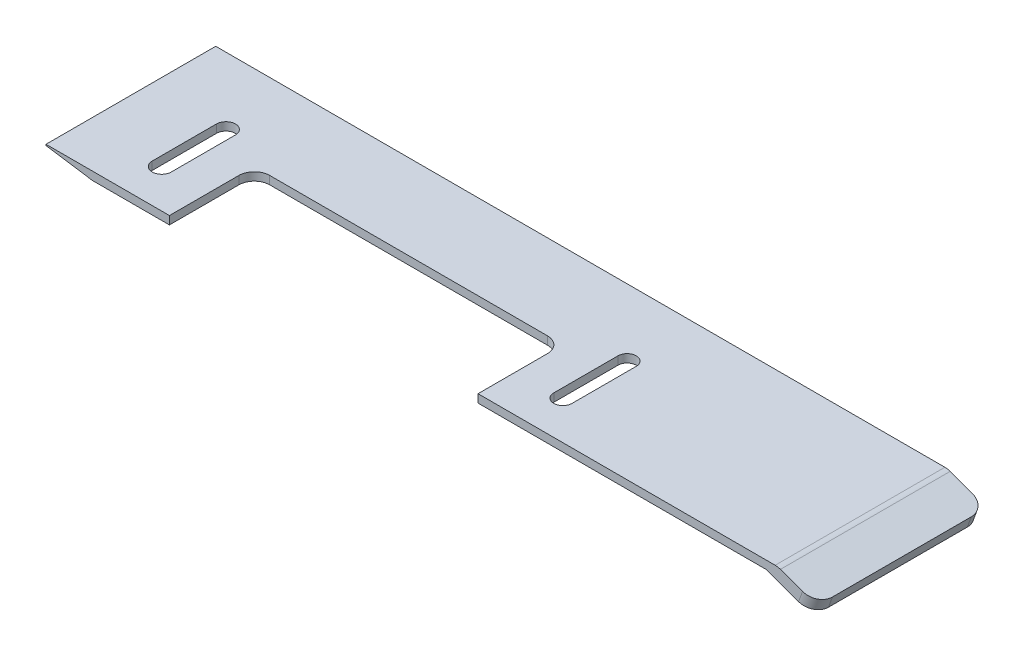
ISO-10303-21;
HEADER;
FILE_DESCRIPTION(('STEP AP214'),'2;1');
FILE_NAME('part.step','',(''),(''),'','','');
FILE_SCHEMA(('AUTOMOTIVE_DESIGN { 1 0 10303 214 1 1 1 1 }'));
ENDSEC;
DATA;
#1=APPLICATION_CONTEXT('core data for automotive mechanical design processes');
#2=APPLICATION_PROTOCOL_DEFINITION('international standard','automotive_design',2000,#1);
#3=PRODUCT_CONTEXT('',#1,'mechanical');
#4=PRODUCT('Part','Part','',(#3));
#5=PRODUCT_RELATED_PRODUCT_CATEGORY('part','',(#4));
#6=PRODUCT_DEFINITION_FORMATION('','',#4);
#7=PRODUCT_DEFINITION_CONTEXT('part definition',#1,'design');
#8=PRODUCT_DEFINITION('design','',#6,#7);
#9=PRODUCT_DEFINITION_SHAPE('','',#8);
#10=(LENGTH_UNIT() NAMED_UNIT(*) SI_UNIT(.MILLI.,.METRE.));
#11=(NAMED_UNIT(*) PLANE_ANGLE_UNIT() SI_UNIT($,.RADIAN.));
#12=(NAMED_UNIT(*) SI_UNIT($,.STERADIAN.) SOLID_ANGLE_UNIT());
#13=UNCERTAINTY_MEASURE_WITH_UNIT(LENGTH_MEASURE(1.E-05),#10,'distance_accuracy_value','');
#14=(GEOMETRIC_REPRESENTATION_CONTEXT(3) GLOBAL_UNCERTAINTY_ASSIGNED_CONTEXT((#13)) GLOBAL_UNIT_ASSIGNED_CONTEXT((#10,
#11,#12)) REPRESENTATION_CONTEXT('',''));
#15=CARTESIAN_POINT('',(0.,0.,0.));
#16=DIRECTION('',(0.,0.,1.));
#17=DIRECTION('',(1.,0.,0.));
#18=AXIS2_PLACEMENT_3D('',#15,#16,#17);
#19=CARTESIAN_POINT('',(0.,0.,22.));
#20=DIRECTION('',(0.,0.,-1.));
#21=DIRECTION('',(-1.,0.,0.));
#22=AXIS2_PLACEMENT_3D('',#19,#20,#21);
#23=PLANE('',#22);
#24=DIRECTION('',(-1.,0.,0.));
#25=VECTOR('',#24,1.);
#26=CARTESIAN_POINT('',(-70.9220106473936,6.21881141029235,22.));
#27=LINE('',#26,#25);
#28=CARTESIAN_POINT('',(23.5939315975531,6.21881141029235,22.));
#29=VERTEX_POINT('',#28);
#30=CARTESIAN_POINT('',(-14.9220106473936,6.21881141029235,22.));
#31=VERTEX_POINT('',#30);
#32=EDGE_CURVE('E277',#29,#31,#27,.T.);
#33=ORIENTED_EDGE('',*,*,#32,.T.);
#34=DIRECTION('',(0.,-1.,0.));
#35=VECTOR('',#34,1.);
#36=CARTESIAN_POINT('',(-14.9220106473936,0.,22.));
#37=LINE('',#36,#35);
#38=CARTESIAN_POINT('',(-14.9220106473936,5.16084952604156,22.));
#39=VERTEX_POINT('',#38);
#40=EDGE_CURVE('E341',#31,#39,#37,.T.);
#41=ORIENTED_EDGE('',*,*,#40,.T.);
#42=DIRECTION('',(1.,0.,0.));
#43=VECTOR('',#42,1.);
#44=CARTESIAN_POINT('',(22.4676053463481,5.16084952604156,22.));
#45=LINE('',#44,#43);
#46=CARTESIAN_POINT('',(22.4676053463481,5.16084952604156,22.));
#47=VERTEX_POINT('',#46);
#48=EDGE_CURVE('E266',#39,#47,#45,.T.);
#49=ORIENTED_EDGE('',*,*,#48,.T.);
#50=DIRECTION('',(0.939692620785908,-0.34202014332567,0.));
#51=VECTOR('',#50,1.);
#52=CARTESIAN_POINT('',(28.5078954962255,2.96236370515487,22.));
#53=LINE('',#52,#51);
#54=CARTESIAN_POINT('',(26.6285102546537,3.64640399180621,22.));
#55=VERTEX_POINT('',#54);
#56=EDGE_CURVE('E270',#47,#55,#53,.T.);
#57=ORIENTED_EDGE('',*,*,#56,.T.);
#58=DIRECTION('',(0.342020143325671,0.939692620785908,0.));
#59=VECTOR('',#58,1.);
#60=CARTESIAN_POINT('',(22.3416346289616,-8.1316899897931,22.));
#61=LINE('',#60,#59);
#62=CARTESIAN_POINT('',(27.1415404696422,5.05594292298507,22.));
#63=VERTEX_POINT('',#62);
#64=EDGE_CURVE('E311',#55,#63,#61,.T.);
#65=ORIENTED_EDGE('',*,*,#64,.T.);
#66=DIRECTION('',(-0.939692620785908,0.342020143325669,0.));
#67=VECTOR('',#66,1.);
#68=CARTESIAN_POINT('',(23.9465855589701,6.21881141029235,22.));
#69=LINE('',#68,#67);
#70=CARTESIAN_POINT('',(24.2779718842044,6.09819665186417,22.));
#71=VERTEX_POINT('',#70);
#72=EDGE_CURVE('E273',#63,#71,#69,.T.);
#73=ORIENTED_EDGE('',*,*,#72,.T.);
#74=CARTESIAN_POINT('',(23.5939315975531,4.21881141029235,22.));
#75=DIRECTION('',(0.,0.,-1.));
#76=DIRECTION('',(-1.,0.,0.));
#77=AXIS2_PLACEMENT_3D('',#74,#75,#76);
#78=CIRCLE('',#77,2.);
#79=EDGE_CURVE('E336',#71,#29,#78,.F.);
#80=ORIENTED_EDGE('',*,*,#79,.T.);
#81=EDGE_LOOP('',(#33,#41,#49,#57,#65,#73,#80));
#82=FACE_BOUND('',#81,.T.);
#83=ADVANCED_FACE('F33',(#82),#23,.F.);
#84=CARTESIAN_POINT('',(-70.9220106473936,6.06099027058349,22.));
#85=DIRECTION('',(1.,0.,0.));
#86=DIRECTION('',(0.,0.,-1.));
#87=AXIS2_PLACEMENT_3D('',#84,#85,#86);
#88=PLANE('',#87);
#89=DIRECTION('',(0.,-1.,0.));
#90=VECTOR('',#89,1.);
#91=CARTESIAN_POINT('',(-70.9220106473936,6.06099027058349,0.));
#92=LINE('',#91,#90);
#93=CARTESIAN_POINT('',(-70.9220106473936,6.21881141029235,0.));
#94=VERTEX_POINT('',#93);
#95=CARTESIAN_POINT('',(-70.9220106473936,6.06099027058349,0.));
#96=VERTEX_POINT('',#95);
#97=EDGE_CURVE('E259',#94,#96,#92,.T.);
#98=ORIENTED_EDGE('',*,*,#97,.T.);
#99=DIRECTION('',(0.,0.,-1.));
#100=VECTOR('',#99,1.);
#101=CARTESIAN_POINT('',(-70.9220106473936,6.06099027058349,22.));
#102=LINE('',#101,#100);
#103=CARTESIAN_POINT('',(-70.9220106473936,6.06099027058349,22.));
#104=VERTEX_POINT('',#103);
#105=EDGE_CURVE('E308',#104,#96,#102,.T.);
#106=ORIENTED_EDGE('',*,*,#105,.F.);
#107=DIRECTION('',(0.,-1.,0.));
#108=VECTOR('',#107,1.);
#109=CARTESIAN_POINT('',(-70.9220106473936,6.06099027058349,22.));
#110=LINE('',#109,#108);
#111=CARTESIAN_POINT('',(-70.9220106473936,6.21881141029235,22.));
#112=VERTEX_POINT('',#111);
#113=EDGE_CURVE('E260',#112,#104,#110,.T.);
#114=ORIENTED_EDGE('',*,*,#113,.F.);
#115=DIRECTION('',(0.,0.,-1.));
#116=VECTOR('',#115,1.);
#117=CARTESIAN_POINT('',(-70.9220106473936,6.21881141029235,22.));
#118=LINE('',#117,#116);
#119=EDGE_CURVE('E280',#112,#94,#118,.T.);
#120=ORIENTED_EDGE('',*,*,#119,.T.);
#121=EDGE_LOOP('',(#98,#106,#114,#120));
#122=FACE_BOUND('',#121,.T.);
#123=ADVANCED_FACE('F444',(#122),#88,.F.);
#124=CARTESIAN_POINT('',(-64.9220106473936,5.16084952604155,22.));
#125=DIRECTION('',(0.148363140244914,0.988932949505005,0.));
#126=DIRECTION('',(-0.988932949505005,0.148363140244914,0.));
#127=AXIS2_PLACEMENT_3D('',#124,#125,#126);
#128=PLANE('',#127);
#129=DIRECTION('',(0.988932949505005,-0.148363140244914,0.));
#130=VECTOR('',#129,1.);
#131=CARTESIAN_POINT('',(-64.9220106473936,5.16084952604155,0.));
#132=LINE('',#131,#130);
#133=CARTESIAN_POINT('',(-64.9220106473936,5.16084952604155,0.));
#134=VERTEX_POINT('',#133);
#135=EDGE_CURVE('E283',#96,#134,#132,.T.);
#136=ORIENTED_EDGE('',*,*,#135,.T.);
#137=DIRECTION('',(0.,0.,-1.));
#138=VECTOR('',#137,1.);
#139=CARTESIAN_POINT('',(-64.9220106473936,5.16084952604155,22.));
#140=LINE('',#139,#138);
#141=CARTESIAN_POINT('',(-64.9220106473936,5.16084952604155,22.));
#142=VERTEX_POINT('',#141);
#143=EDGE_CURVE('E305',#142,#134,#140,.T.);
#144=ORIENTED_EDGE('',*,*,#143,.F.);
#145=DIRECTION('',(0.988932949505005,-0.148363140244914,0.));
#146=VECTOR('',#145,1.);
#147=CARTESIAN_POINT('',(-64.9220106473936,5.16084952604155,22.));
#148=LINE('',#147,#146);
#149=EDGE_CURVE('E263',#104,#142,#148,.T.);
#150=ORIENTED_EDGE('',*,*,#149,.F.);
#151=ORIENTED_EDGE('',*,*,#105,.T.);
#152=EDGE_LOOP('',(#136,#144,#150,#151));
#153=FACE_BOUND('',#152,.T.);
#154=ADVANCED_FACE('F446',(#153),#128,.F.);
#155=CARTESIAN_POINT('',(22.4676053463481,5.16084952604156,22.));
#156=DIRECTION('',(0.,1.,0.));
#157=DIRECTION('',(-1.,0.,0.));
#158=AXIS2_PLACEMENT_3D('',#155,#156,#157);
#159=PLANE('',#158);
#160=DIRECTION('',(0.,0.,1.));
#161=VECTOR('',#160,1.);
#162=CARTESIAN_POINT('',(-59.6885627096651,5.16084952604156,8.67422642033291));
#163=LINE('',#162,#161);
#164=CARTESIAN_POINT('',(-59.6885627096651,5.16084952604156,8.67422642033291));
#165=VERTEX_POINT('',#164);
#166=CARTESIAN_POINT('',(-59.6885627096651,5.16084952604156,17.));
#167=VERTEX_POINT('',#166);
#168=EDGE_CURVE('E209',#165,#167,#163,.T.);
#169=ORIENTED_EDGE('',*,*,#168,.F.);
#170=CARTESIAN_POINT('',(-60.9220106473936,5.16084952604156,8.67422642033291));
#171=DIRECTION('',(0.,-1.,0.));
#172=DIRECTION('',(1.,0.,0.));
#173=AXIS2_PLACEMENT_3D('',#170,#171,#172);
#174=CIRCLE('',#173,1.23344793772846);
#175=CARTESIAN_POINT('',(-62.155458585122,5.16084952604155,8.67422642033291));
#176=VERTEX_POINT('',#175);
#177=EDGE_CURVE('E214',#176,#165,#174,.T.);
#178=ORIENTED_EDGE('',*,*,#177,.F.);
#179=DIRECTION('',(0.,0.,-1.));
#180=VECTOR('',#179,1.);
#181=CARTESIAN_POINT('',(-62.155458585122,5.16084952604155,8.67422642033291));
#182=LINE('',#181,#180);
#183=CARTESIAN_POINT('',(-62.155458585122,5.16084952604156,17.));
#184=VERTEX_POINT('',#183);
#185=EDGE_CURVE('E219',#184,#176,#182,.T.);
#186=ORIENTED_EDGE('',*,*,#185,.F.);
#187=CARTESIAN_POINT('',(-60.9220106473936,5.16084952604156,17.));
#188=DIRECTION('',(0.,-1.,0.));
#189=DIRECTION('',(1.,0.,0.));
#190=AXIS2_PLACEMENT_3D('',#187,#188,#189);
#191=CIRCLE('',#190,1.23344793772846);
#192=EDGE_CURVE('E198',#167,#184,#191,.T.);
#193=ORIENTED_EDGE('',*,*,#192,.F.);
#194=EDGE_LOOP('',(#169,#178,#186,#193));
#195=FACE_BOUND('',#194,.T.);
#196=DIRECTION('',(0.,0.,1.));
#197=VECTOR('',#196,1.);
#198=CARTESIAN_POINT('',(-7.73995637373713,5.16084952604156,8.67422642033291));
#199=LINE('',#198,#197);
#200=CARTESIAN_POINT('',(-7.73995637373713,5.16084952604156,8.67422642033291));
#201=VERTEX_POINT('',#200);
#202=CARTESIAN_POINT('',(-7.73995637373713,5.16084952604156,17.));
#203=VERTEX_POINT('',#202);
#204=EDGE_CURVE('E231',#201,#203,#199,.T.);
#205=ORIENTED_EDGE('',*,*,#204,.F.);
#206=CARTESIAN_POINT('',(-8.92201064739357,5.16084952604156,8.67422642033291));
#207=DIRECTION('',(0.,-1.,0.));
#208=DIRECTION('',(1.,0.,0.));
#209=AXIS2_PLACEMENT_3D('',#206,#207,#208);
#210=CIRCLE('',#209,1.18205427365644);
#211=CARTESIAN_POINT('',(-10.10406492105,5.16084952604156,8.67422642033291));
#212=VERTEX_POINT('',#211);
#213=EDGE_CURVE('E229',#212,#201,#210,.T.);
#214=ORIENTED_EDGE('',*,*,#213,.F.);
#215=DIRECTION('',(0.,0.,-1.));
#216=VECTOR('',#215,1.);
#217=CARTESIAN_POINT('',(-10.10406492105,5.16084952604156,8.67422642033291));
#218=LINE('',#217,#216);
#219=CARTESIAN_POINT('',(-10.10406492105,5.16084952604156,17.));
#220=VERTEX_POINT('',#219);
#221=EDGE_CURVE('E237',#220,#212,#218,.T.);
#222=ORIENTED_EDGE('',*,*,#221,.F.);
#223=CARTESIAN_POINT('',(-8.92201064739357,5.16084952604156,17.));
#224=DIRECTION('',(0.,-1.,0.));
#225=DIRECTION('',(1.,0.,0.));
#226=AXIS2_PLACEMENT_3D('',#223,#224,#225);
#227=CIRCLE('',#226,1.18205427365644);
#228=EDGE_CURVE('E234',#203,#220,#227,.T.);
#229=ORIENTED_EDGE('',*,*,#228,.F.);
#230=EDGE_LOOP('',(#205,#214,#222,#229));
#231=FACE_BOUND('',#230,.T.);
#232=ORIENTED_EDGE('',*,*,#48,.F.);
#233=DIRECTION('',(0.,0.,1.));
#234=VECTOR('',#233,1.);
#235=CARTESIAN_POINT('',(-14.9220106473936,5.16084952604156,29.4559216488466));
#236=LINE('',#235,#234);
#237=CARTESIAN_POINT('',(-14.9220106473936,5.16084952604156,13.));
#238=VERTEX_POINT('',#237);
#239=EDGE_CURVE('E226',#238,#39,#236,.T.);
#240=ORIENTED_EDGE('',*,*,#239,.F.);
#241=CARTESIAN_POINT('',(-16.9220106473936,5.16084952604156,13.));
#242=DIRECTION('',(0.,1.,0.));
#243=DIRECTION('',(-1.,0.,0.));
#244=AXIS2_PLACEMENT_3D('',#241,#242,#243);
#245=CIRCLE('',#244,2.);
#246=CARTESIAN_POINT('',(-16.9220106473936,5.16084952604156,11.));
#247=VERTEX_POINT('',#246);
#248=EDGE_CURVE('E377',#238,#247,#245,.T.);
#249=ORIENTED_EDGE('',*,*,#248,.T.);
#250=DIRECTION('',(1.,0.,0.));
#251=VECTOR('',#250,1.);
#252=CARTESIAN_POINT('',(-14.9220106473936,5.16084952604156,11.));
#253=LINE('',#252,#251);
#254=CARTESIAN_POINT('',(-52.9220106473936,5.16084952604156,11.));
#255=VERTEX_POINT('',#254);
#256=EDGE_CURVE('E252',#255,#247,#253,.T.);
#257=ORIENTED_EDGE('',*,*,#256,.F.);
#258=CARTESIAN_POINT('',(-52.9220106473936,5.16084952604156,13.));
#259=DIRECTION('',(0.,1.,0.));
#260=DIRECTION('',(-1.,0.,0.));
#261=AXIS2_PLACEMENT_3D('',#258,#259,#260);
#262=CIRCLE('',#261,2.);
#263=CARTESIAN_POINT('',(-54.9220106473936,5.16084952604156,13.));
#264=VERTEX_POINT('',#263);
#265=EDGE_CURVE('E41',#255,#264,#262,.T.);
#266=ORIENTED_EDGE('',*,*,#265,.T.);
#267=DIRECTION('',(0.,0.,-1.));
#268=VECTOR('',#267,1.);
#269=CARTESIAN_POINT('',(-54.9220106473936,5.16084952604156,29.4559216488466));
#270=LINE('',#269,#268);
#271=CARTESIAN_POINT('',(-54.9220106473936,5.16084952604156,22.));
#272=VERTEX_POINT('',#271);
#273=EDGE_CURVE('E250',#272,#264,#270,.T.);
#274=ORIENTED_EDGE('',*,*,#273,.F.);
#275=EDGE_CURVE('E267',#142,#272,#45,.T.);
#276=ORIENTED_EDGE('',*,*,#275,.F.);
#277=ORIENTED_EDGE('',*,*,#143,.T.);
#278=DIRECTION('',(1.,0.,0.));
#279=VECTOR('',#278,1.);
#280=CARTESIAN_POINT('',(22.4676053463481,5.16084952604156,0.));
#281=LINE('',#280,#279);
#282=CARTESIAN_POINT('',(22.4676053463481,5.16084952604156,0.));
#283=VERTEX_POINT('',#282);
#284=EDGE_CURVE('E285',#134,#283,#281,.T.);
#285=ORIENTED_EDGE('',*,*,#284,.T.);
#286=DIRECTION('',(0.,0.,-1.));
#287=VECTOR('',#286,1.);
#288=CARTESIAN_POINT('',(22.4676053463481,5.16084952604156,22.));
#289=LINE('',#288,#287);
#290=EDGE_CURVE('E302',#47,#283,#289,.T.);
#291=ORIENTED_EDGE('',*,*,#290,.F.);
#292=EDGE_LOOP('',(#232,#240,#249,#257,#266,#274,#276,#277,#285,#291));
#293=FACE_BOUND('',#292,.T.);
#294=ADVANCED_FACE('F216',(#195,#231,#293),#159,.F.);
#295=CARTESIAN_POINT('',(28.5078954962255,2.96236370515487,22.));
#296=DIRECTION('',(0.34202014332567,0.939692620785908,0.));
#297=DIRECTION('',(-0.939692620785908,0.34202014332567,0.));
#298=AXIS2_PLACEMENT_3D('',#295,#296,#297);
#299=PLANE('',#298);
#300=DIRECTION('',(0.,0.,-1.));
#301=VECTOR('',#300,1.);
#302=CARTESIAN_POINT('',(28.5078954962255,2.96236370515487,22.));
#303=LINE('',#302,#301);
#304=CARTESIAN_POINT('',(28.5078954962255,2.96236370515487,20.));
#305=VERTEX_POINT('',#304);
#306=CARTESIAN_POINT('',(28.5078954962255,2.96236370515487,2.));
#307=VERTEX_POINT('',#306);
#308=EDGE_CURVE('E299',#305,#307,#303,.T.);
#309=ORIENTED_EDGE('',*,*,#308,.F.);
#310=CARTESIAN_POINT('',(26.6285102546536,3.64640399180621,20.));
#311=DIRECTION('',(0.34202014332567,0.939692620785908,0.));
#312=DIRECTION('',(-0.939692620785908,0.34202014332567,0.));
#313=AXIS2_PLACEMENT_3D('',#310,#311,#312);
#314=CIRCLE('',#313,2.);
#315=EDGE_CURVE('E325',#305,#55,#314,.F.);
#316=ORIENTED_EDGE('',*,*,#315,.T.);
#317=ORIENTED_EDGE('',*,*,#56,.F.);
#318=ORIENTED_EDGE('',*,*,#290,.T.);
#319=DIRECTION('',(0.939692620785908,-0.34202014332567,0.));
#320=VECTOR('',#319,1.);
#321=CARTESIAN_POINT('',(28.5078954962255,2.96236370515487,0.));
#322=LINE('',#321,#320);
#323=CARTESIAN_POINT('',(26.6285102546536,3.64640399180621,0.));
#324=VERTEX_POINT('',#323);
#325=EDGE_CURVE('E287',#283,#324,#322,.T.);
#326=ORIENTED_EDGE('',*,*,#325,.T.);
#327=CARTESIAN_POINT('',(26.6285102546536,3.64640399180621,2.));
#328=DIRECTION('',(0.34202014332567,0.939692620785908,0.));
#329=DIRECTION('',(-0.939692620785908,0.34202014332567,0.));
#330=AXIS2_PLACEMENT_3D('',#327,#328,#329);
#331=CIRCLE('',#330,2.);
#332=EDGE_CURVE('E323',#324,#307,#331,.F.);
#333=ORIENTED_EDGE('',*,*,#332,.T.);
#334=EDGE_LOOP('',(#309,#316,#317,#318,#326,#333));
#335=FACE_BOUND('',#334,.T.);
#336=ADVANCED_FACE('F420',(#335),#299,.F.);
#337=CARTESIAN_POINT('',(29.020925711214,4.37190263633373,22.));
#338=DIRECTION('',(-0.939692620785908,0.342020143325671,0.));
#339=DIRECTION('',(-0.342020143325671,-0.939692620785908,0.));
#340=AXIS2_PLACEMENT_3D('',#337,#338,#339);
#341=PLANE('',#340);
#342=DIRECTION('',(0.,0.,-1.));
#343=VECTOR('',#342,1.);
#344=CARTESIAN_POINT('',(29.020925711214,4.37190263633373,22.));
#345=LINE('',#344,#343);
#346=CARTESIAN_POINT('',(29.020925711214,4.37190263633373,20.));
#347=VERTEX_POINT('',#346);
#348=CARTESIAN_POINT('',(29.020925711214,4.37190263633373,2.));
#349=VERTEX_POINT('',#348);
#350=EDGE_CURVE('E296',#347,#349,#345,.T.);
#351=ORIENTED_EDGE('',*,*,#350,.F.);
#352=DIRECTION('',(0.342020143325671,0.939692620785908,0.));
#353=VECTOR('',#352,1.);
#354=CARTESIAN_POINT('',(29.020925711214,4.37190263633373,20.));
#355=LINE('',#354,#353);
#356=EDGE_CURVE('E321',#347,#305,#355,.F.);
#357=ORIENTED_EDGE('',*,*,#356,.T.);
#358=ORIENTED_EDGE('',*,*,#308,.T.);
#359=DIRECTION('',(0.342020143325671,0.939692620785908,0.));
#360=VECTOR('',#359,1.);
#361=CARTESIAN_POINT('',(29.020925711214,4.37190263633373,2.));
#362=LINE('',#361,#360);
#363=EDGE_CURVE('E318',#307,#349,#362,.T.);
#364=ORIENTED_EDGE('',*,*,#363,.T.);
#365=EDGE_LOOP('',(#351,#357,#358,#364));
#366=FACE_BOUND('',#365,.T.);
#367=ADVANCED_FACE('F427',(#366),#341,.F.);
#368=CARTESIAN_POINT('',(23.9465855589701,6.21881141029235,22.));
#369=DIRECTION('',(-0.342020143325669,-0.939692620785908,0.));
#370=DIRECTION('',(0.939692620785908,-0.342020143325669,0.));
#371=AXIS2_PLACEMENT_3D('',#368,#369,#370);
#372=PLANE('',#371);
#373=DIRECTION('',(-0.939692620785908,0.342020143325669,0.));
#374=VECTOR('',#373,1.);
#375=CARTESIAN_POINT('',(23.9465855589701,6.21881141029235,0.));
#376=LINE('',#375,#374);
#377=CARTESIAN_POINT('',(27.1415404696422,5.05594292298507,0.));
#378=VERTEX_POINT('',#377);
#379=CARTESIAN_POINT('',(24.2779718842044,6.09819665186417,0.));
#380=VERTEX_POINT('',#379);
#381=EDGE_CURVE('E290',#378,#380,#376,.T.);
#382=ORIENTED_EDGE('',*,*,#381,.T.);
#383=DIRECTION('',(0.,0.,-1.));
#384=VECTOR('',#383,1.);
#385=CARTESIAN_POINT('',(24.2779718842044,6.09819665186417,22.));
#386=LINE('',#385,#384);
#387=EDGE_CURVE('E334',#380,#71,#386,.F.);
#388=ORIENTED_EDGE('',*,*,#387,.T.);
#389=ORIENTED_EDGE('',*,*,#72,.F.);
#390=CARTESIAN_POINT('',(27.1415404696422,5.05594292298507,20.));
#391=DIRECTION('',(-0.342020143325669,-0.939692620785908,0.));
#392=DIRECTION('',(0.939692620785908,-0.342020143325669,0.));
#393=AXIS2_PLACEMENT_3D('',#390,#391,#392);
#394=CIRCLE('',#393,2.);
#395=EDGE_CURVE('E316',#63,#347,#394,.F.);
#396=ORIENTED_EDGE('',*,*,#395,.T.);
#397=ORIENTED_EDGE('',*,*,#350,.T.);
#398=CARTESIAN_POINT('',(27.1415404696422,5.05594292298507,2.));
#399=DIRECTION('',(-0.342020143325669,-0.939692620785908,0.));
#400=DIRECTION('',(0.939692620785908,-0.342020143325669,0.));
#401=AXIS2_PLACEMENT_3D('',#398,#399,#400);
#402=CIRCLE('',#401,2.);
#403=EDGE_CURVE('E314',#349,#378,#402,.F.);
#404=ORIENTED_EDGE('',*,*,#403,.T.);
#405=EDGE_LOOP('',(#382,#388,#389,#396,#397,#404));
#406=FACE_BOUND('',#405,.T.);
#407=ADVANCED_FACE('F430',(#406),#372,.F.);
#408=CARTESIAN_POINT('',(-70.9220106473936,6.21881141029235,22.));
#409=DIRECTION('',(0.,-1.,0.));
#410=DIRECTION('',(0.,0.,-1.));
#411=AXIS2_PLACEMENT_3D('',#408,#409,#410);
#412=PLANE('',#411);
#413=DIRECTION('',(0.,0.,-1.));
#414=VECTOR('',#413,1.);
#415=CARTESIAN_POINT('',(-62.155458585122,6.21881141029235,22.));
#416=LINE('',#415,#414);
#417=CARTESIAN_POINT('',(-62.155458585122,6.21881141029235,17.));
#418=VERTEX_POINT('',#417);
#419=CARTESIAN_POINT('',(-62.155458585122,6.21881141029235,8.67422642033291));
#420=VERTEX_POINT('',#419);
#421=EDGE_CURVE('E362',#418,#420,#416,.T.);
#422=ORIENTED_EDGE('',*,*,#421,.T.);
#423=CARTESIAN_POINT('',(-60.9220106473936,6.21881141029235,8.67422642033291));
#424=DIRECTION('',(0.,-1.,0.));
#425=DIRECTION('',(0.,0.,-1.));
#426=AXIS2_PLACEMENT_3D('',#423,#424,#425);
#427=CIRCLE('',#426,1.23344793772846);
#428=CARTESIAN_POINT('',(-59.6885627096651,6.21881141029235,8.67422642033291));
#429=VERTEX_POINT('',#428);
#430=EDGE_CURVE('E365',#420,#429,#427,.T.);
#431=ORIENTED_EDGE('',*,*,#430,.T.);
#432=DIRECTION('',(0.,0.,1.));
#433=VECTOR('',#432,1.);
#434=CARTESIAN_POINT('',(-59.6885627096651,6.21881141029235,22.));
#435=LINE('',#434,#433);
#436=CARTESIAN_POINT('',(-59.6885627096651,6.21881141029235,17.));
#437=VERTEX_POINT('',#436);
#438=EDGE_CURVE('E359',#429,#437,#435,.T.);
#439=ORIENTED_EDGE('',*,*,#438,.T.);
#440=CARTESIAN_POINT('',(-60.9220106473936,6.21881141029235,17.));
#441=DIRECTION('',(0.,-1.,0.));
#442=DIRECTION('',(0.,0.,-1.));
#443=AXIS2_PLACEMENT_3D('',#440,#441,#442);
#444=CIRCLE('',#443,1.23344793772846);
#445=EDGE_CURVE('E201',#437,#418,#444,.T.);
#446=ORIENTED_EDGE('',*,*,#445,.T.);
#447=EDGE_LOOP('',(#422,#431,#439,#446));
#448=FACE_BOUND('',#447,.T.);
#449=DIRECTION('',(0.,0.,-1.));
#450=VECTOR('',#449,1.);
#451=CARTESIAN_POINT('',(-10.10406492105,6.21881141029235,22.));
#452=LINE('',#451,#450);
#453=CARTESIAN_POINT('',(-10.10406492105,6.21881141029235,17.));
#454=VERTEX_POINT('',#453);
#455=CARTESIAN_POINT('',(-10.10406492105,6.21881141029235,8.67422642033291));
#456=VERTEX_POINT('',#455);
#457=EDGE_CURVE('E353',#454,#456,#452,.T.);
#458=ORIENTED_EDGE('',*,*,#457,.T.);
#459=CARTESIAN_POINT('',(-8.92201064739357,6.21881141029235,8.67422642033291));
#460=DIRECTION('',(0.,-1.,0.));
#461=DIRECTION('',(0.,0.,-1.));
#462=AXIS2_PLACEMENT_3D('',#459,#460,#461);
#463=CIRCLE('',#462,1.18205427365644);
#464=CARTESIAN_POINT('',(-7.73995637373713,6.21881141029235,8.67422642033291));
#465=VERTEX_POINT('',#464);
#466=EDGE_CURVE('E356',#456,#465,#463,.T.);
#467=ORIENTED_EDGE('',*,*,#466,.T.);
#468=DIRECTION('',(0.,0.,1.));
#469=VECTOR('',#468,1.);
#470=CARTESIAN_POINT('',(-7.73995637373713,6.21881141029235,22.));
#471=LINE('',#470,#469);
#472=CARTESIAN_POINT('',(-7.73995637373713,6.21881141029235,17.));
#473=VERTEX_POINT('',#472);
#474=EDGE_CURVE('E347',#465,#473,#471,.T.);
#475=ORIENTED_EDGE('',*,*,#474,.T.);
#476=CARTESIAN_POINT('',(-8.92201064739357,6.21881141029235,17.));
#477=DIRECTION('',(0.,-1.,0.));
#478=DIRECTION('',(0.,0.,-1.));
#479=AXIS2_PLACEMENT_3D('',#476,#477,#478);
#480=CIRCLE('',#479,1.18205427365644);
#481=EDGE_CURVE('E350',#473,#454,#480,.T.);
#482=ORIENTED_EDGE('',*,*,#481,.T.);
#483=EDGE_LOOP('',(#458,#467,#475,#482));
#484=FACE_BOUND('',#483,.T.);
#485=DIRECTION('',(0.,0.,-1.));
#486=VECTOR('',#485,1.);
#487=CARTESIAN_POINT('',(-54.9220106473936,6.21881141029235,22.));
#488=LINE('',#487,#486);
#489=CARTESIAN_POINT('',(-54.9220106473936,6.21881141029235,22.));
#490=VERTEX_POINT('',#489);
#491=CARTESIAN_POINT('',(-54.9220106473936,6.21881141029235,13.));
#492=VERTEX_POINT('',#491);
#493=EDGE_CURVE('E255',#490,#492,#488,.T.);
#494=ORIENTED_EDGE('',*,*,#493,.T.);
#495=CARTESIAN_POINT('',(-52.9220106473936,6.21881141029235,13.));
#496=DIRECTION('',(0.,-1.,0.));
#497=DIRECTION('',(0.,0.,-1.));
#498=AXIS2_PLACEMENT_3D('',#495,#496,#497);
#499=CIRCLE('',#498,2.);
#500=CARTESIAN_POINT('',(-52.9220106473936,6.21881141029235,11.));
#501=VERTEX_POINT('',#500);
#502=EDGE_CURVE('E11',#492,#501,#499,.T.);
#503=ORIENTED_EDGE('',*,*,#502,.T.);
#504=DIRECTION('',(1.,0.,0.));
#505=VECTOR('',#504,1.);
#506=CARTESIAN_POINT('',(-70.9220106473936,6.21881141029235,11.));
#507=LINE('',#506,#505);
#508=CARTESIAN_POINT('',(-16.9220106473936,6.21881141029235,11.));
#509=VERTEX_POINT('',#508);
#510=EDGE_CURVE('E344',#501,#509,#507,.T.);
#511=ORIENTED_EDGE('',*,*,#510,.T.);
#512=CARTESIAN_POINT('',(-16.9220106473936,6.21881141029235,13.));
#513=DIRECTION('',(0.,-1.,0.));
#514=DIRECTION('',(0.,0.,-1.));
#515=AXIS2_PLACEMENT_3D('',#512,#513,#514);
#516=CIRCLE('',#515,2.);
#517=CARTESIAN_POINT('',(-14.9220106473936,6.21881141029235,13.));
#518=VERTEX_POINT('',#517);
#519=EDGE_CURVE('E379',#509,#518,#516,.T.);
#520=ORIENTED_EDGE('',*,*,#519,.T.);
#521=DIRECTION('',(0.,0.,1.));
#522=VECTOR('',#521,1.);
#523=CARTESIAN_POINT('',(-14.9220106473936,6.21881141029235,22.));
#524=LINE('',#523,#522);
#525=EDGE_CURVE('E257',#518,#31,#524,.T.);
#526=ORIENTED_EDGE('',*,*,#525,.T.);
#527=ORIENTED_EDGE('',*,*,#32,.F.);
#528=DIRECTION('',(0.,0.,-1.));
#529=VECTOR('',#528,1.);
#530=CARTESIAN_POINT('',(23.5939315975531,6.21881141029235,22.));
#531=LINE('',#530,#529);
#532=CARTESIAN_POINT('',(23.5939315975531,6.21881141029235,0.));
#533=VERTEX_POINT('',#532);
#534=EDGE_CURVE('E329',#29,#533,#531,.T.);
#535=ORIENTED_EDGE('',*,*,#534,.T.);
#536=DIRECTION('',(-1.,0.,0.));
#537=VECTOR('',#536,1.);
#538=CARTESIAN_POINT('',(-70.9220106473936,6.21881141029235,0.));
#539=LINE('',#538,#537);
#540=EDGE_CURVE('E264',#533,#94,#539,.T.);
#541=ORIENTED_EDGE('',*,*,#540,.T.);
#542=ORIENTED_EDGE('',*,*,#119,.F.);
#543=EDGE_CURVE('E276',#490,#112,#27,.T.);
#544=ORIENTED_EDGE('',*,*,#543,.F.);
#545=EDGE_LOOP('',(#494,#503,#511,#520,#526,#527,#535,#541,#542,#544));
#546=FACE_BOUND('',#545,.T.);
#547=ADVANCED_FACE('F383',(#448,#484,#546),#412,.F.);
#548=ORIENTED_EDGE('',*,*,#275,.T.);
#549=DIRECTION('',(0.,1.,0.));
#550=VECTOR('',#549,1.);
#551=CARTESIAN_POINT('',(-54.9220106473936,0.,22.));
#552=LINE('',#551,#550);
#553=EDGE_CURVE('E338',#272,#490,#552,.T.);
#554=ORIENTED_EDGE('',*,*,#553,.T.);
#555=ORIENTED_EDGE('',*,*,#543,.T.);
#556=ORIENTED_EDGE('',*,*,#113,.T.);
#557=ORIENTED_EDGE('',*,*,#149,.T.);
#558=EDGE_LOOP('',(#548,#554,#555,#556,#557));
#559=FACE_BOUND('',#558,.T.);
#560=ADVANCED_FACE('F404',(#559),#23,.F.);
#561=CARTESIAN_POINT('',(0.,0.,0.));
#562=DIRECTION('',(0.,0.,-1.));
#563=DIRECTION('',(-1.,0.,0.));
#564=AXIS2_PLACEMENT_3D('',#561,#562,#563);
#565=PLANE('',#564);
#566=ORIENTED_EDGE('',*,*,#540,.F.);
#567=CARTESIAN_POINT('',(23.5939315975531,4.21881141029235,0.));
#568=DIRECTION('',(0.,0.,-1.));
#569=DIRECTION('',(-1.,0.,0.));
#570=AXIS2_PLACEMENT_3D('',#567,#568,#569);
#571=CIRCLE('',#570,2.);
#572=EDGE_CURVE('E332',#533,#380,#571,.T.);
#573=ORIENTED_EDGE('',*,*,#572,.T.);
#574=ORIENTED_EDGE('',*,*,#381,.F.);
#575=DIRECTION('',(0.342020143325671,0.939692620785908,0.));
#576=VECTOR('',#575,1.);
#577=CARTESIAN_POINT('',(26.6285102546536,3.64640399180621,0.));
#578=LINE('',#577,#576);
#579=EDGE_CURVE('E327',#378,#324,#578,.F.);
#580=ORIENTED_EDGE('',*,*,#579,.T.);
#581=ORIENTED_EDGE('',*,*,#325,.F.);
#582=ORIENTED_EDGE('',*,*,#284,.F.);
#583=ORIENTED_EDGE('',*,*,#135,.F.);
#584=ORIENTED_EDGE('',*,*,#97,.F.);
#585=EDGE_LOOP('',(#566,#573,#574,#580,#581,#582,#583,#584));
#586=FACE_BOUND('',#585,.T.);
#587=ADVANCED_FACE('F413',(#586),#565,.T.);
#588=CARTESIAN_POINT('',(22.3416346289616,-8.1316899897931,20.));
#589=DIRECTION('',(0.342020143325671,0.939692620785908,0.));
#590=DIRECTION('',(-0.939692620785908,0.342020143325671,0.));
#591=AXIS2_PLACEMENT_3D('',#588,#589,#590);
#592=CYLINDRICAL_SURFACE('',#591,2.);
#593=ORIENTED_EDGE('',*,*,#315,.F.);
#594=ORIENTED_EDGE('',*,*,#356,.F.);
#595=ORIENTED_EDGE('',*,*,#395,.F.);
#596=ORIENTED_EDGE('',*,*,#64,.F.);
#597=EDGE_LOOP('',(#593,#594,#595,#596));
#598=FACE_BOUND('',#597,.T.);
#599=ADVANCED_FACE('F435',(#598),#592,.T.);
#600=CARTESIAN_POINT('',(27.1415404696422,5.05594292298507,2.));
#601=DIRECTION('',(-0.342020143325671,-0.939692620785908,0.));
#602=DIRECTION('',(0.939692620785908,-0.342020143325671,0.));
#603=AXIS2_PLACEMENT_3D('',#600,#601,#602);
#604=CYLINDRICAL_SURFACE('',#603,2.);
#605=ORIENTED_EDGE('',*,*,#332,.F.);
#606=ORIENTED_EDGE('',*,*,#579,.F.);
#607=ORIENTED_EDGE('',*,*,#403,.F.);
#608=ORIENTED_EDGE('',*,*,#363,.F.);
#609=EDGE_LOOP('',(#605,#606,#607,#608));
#610=FACE_BOUND('',#609,.T.);
#611=ADVANCED_FACE('F424',(#610),#604,.T.);
#612=CARTESIAN_POINT('',(23.5939315975531,4.21881141029235,22.));
#613=DIRECTION('',(0.,0.,-1.));
#614=DIRECTION('',(-1.,0.,0.));
#615=AXIS2_PLACEMENT_3D('',#612,#613,#614);
#616=CYLINDRICAL_SURFACE('',#615,2.);
#617=ORIENTED_EDGE('',*,*,#79,.F.);
#618=ORIENTED_EDGE('',*,*,#387,.F.);
#619=ORIENTED_EDGE('',*,*,#572,.F.);
#620=ORIENTED_EDGE('',*,*,#534,.F.);
#621=EDGE_LOOP('',(#617,#618,#619,#620));
#622=FACE_BOUND('',#621,.T.);
#623=ADVANCED_FACE('F440',(#622),#616,.T.);
#624=CARTESIAN_POINT('',(-14.9220106473936,35.1608495260416,11.));
#625=DIRECTION('',(0.,0.,-1.));
#626=DIRECTION('',(-1.,0.,0.));
#627=AXIS2_PLACEMENT_3D('',#624,#625,#626);
#628=PLANE('',#627);
#629=ORIENTED_EDGE('',*,*,#256,.T.);
#630=DIRECTION('',(0.,-1.,0.));
#631=VECTOR('',#630,1.);
#632=CARTESIAN_POINT('',(-16.9220106473936,6.21881141029235,11.));
#633=LINE('',#632,#631);
#634=EDGE_CURVE('E374',#247,#509,#633,.F.);
#635=ORIENTED_EDGE('',*,*,#634,.T.);
#636=ORIENTED_EDGE('',*,*,#510,.F.);
#637=DIRECTION('',(0.,-1.,0.));
#638=VECTOR('',#637,1.);
#639=CARTESIAN_POINT('',(-52.9220106473936,5.16084952604156,11.));
#640=LINE('',#639,#638);
#641=EDGE_CURVE('E371',#501,#255,#640,.T.);
#642=ORIENTED_EDGE('',*,*,#641,.T.);
#643=EDGE_LOOP('',(#629,#635,#636,#642));
#644=FACE_BOUND('',#643,.T.);
#645=ADVANCED_FACE('F396',(#644),#628,.F.);
#646=CARTESIAN_POINT('',(-14.9220106473936,35.1608495260416,29.4559216488466));
#647=DIRECTION('',(1.,0.,0.));
#648=DIRECTION('',(0.,1.,0.));
#649=AXIS2_PLACEMENT_3D('',#646,#647,#648);
#650=PLANE('',#649);
#651=ORIENTED_EDGE('',*,*,#525,.F.);
#652=DIRECTION('',(0.,-1.,0.));
#653=VECTOR('',#652,1.);
#654=CARTESIAN_POINT('',(-14.9220106473936,5.16084952604156,13.));
#655=LINE('',#654,#653);
#656=EDGE_CURVE('E368',#518,#238,#655,.T.);
#657=ORIENTED_EDGE('',*,*,#656,.T.);
#658=ORIENTED_EDGE('',*,*,#239,.T.);
#659=ORIENTED_EDGE('',*,*,#40,.F.);
#660=EDGE_LOOP('',(#651,#657,#658,#659));
#661=FACE_BOUND('',#660,.T.);
#662=ADVANCED_FACE('F391',(#661),#650,.F.);
#663=CARTESIAN_POINT('',(-54.9220106473936,35.1608495260416,29.4559216488466));
#664=DIRECTION('',(-1.,0.,0.));
#665=DIRECTION('',(0.,-1.,0.));
#666=AXIS2_PLACEMENT_3D('',#663,#664,#665);
#667=PLANE('',#666);
#668=ORIENTED_EDGE('',*,*,#273,.T.);
#669=DIRECTION('',(0.,-1.,0.));
#670=VECTOR('',#669,1.);
#671=CARTESIAN_POINT('',(-54.9220106473936,6.21881141029235,13.));
#672=LINE('',#671,#670);
#673=EDGE_CURVE('E48',#264,#492,#672,.F.);
#674=ORIENTED_EDGE('',*,*,#673,.T.);
#675=ORIENTED_EDGE('',*,*,#493,.F.);
#676=ORIENTED_EDGE('',*,*,#553,.F.);
#677=EDGE_LOOP('',(#668,#674,#675,#676));
#678=FACE_BOUND('',#677,.T.);
#679=ADVANCED_FACE('F402',(#678),#667,.F.);
#680=CARTESIAN_POINT('',(-8.92201064739357,35.1608495260416,8.67422642033291));
#681=DIRECTION('',(0.,-1.,0.));
#682=DIRECTION('',(1.,0.,0.));
#683=AXIS2_PLACEMENT_3D('',#680,#681,#682);
#684=CYLINDRICAL_SURFACE('',#683,1.18205427365644);
#685=DIRECTION('',(0.,-1.,0.));
#686=VECTOR('',#685,1.);
#687=CARTESIAN_POINT('',(-10.10406492105,35.1608495260416,8.67422642033291));
#688=LINE('',#687,#686);
#689=EDGE_CURVE('E241',#456,#212,#688,.T.);
#690=ORIENTED_EDGE('',*,*,#689,.T.);
#691=ORIENTED_EDGE('',*,*,#213,.T.);
#692=DIRECTION('',(0.,-1.,0.));
#693=VECTOR('',#692,1.);
#694=CARTESIAN_POINT('',(-7.73995637373713,35.1608495260416,8.67422642033291));
#695=LINE('',#694,#693);
#696=EDGE_CURVE('E240',#465,#201,#695,.T.);
#697=ORIENTED_EDGE('',*,*,#696,.F.);
#698=ORIENTED_EDGE('',*,*,#466,.F.);
#699=EDGE_LOOP('',(#690,#691,#697,#698));
#700=FACE_BOUND('',#699,.T.);
#701=ADVANCED_FACE('F526',(#700),#684,.F.);
#702=CARTESIAN_POINT('',(-10.10406492105,35.1608495260416,8.67422642033291));
#703=DIRECTION('',(-1.,0.,0.));
#704=DIRECTION('',(0.,-1.,0.));
#705=AXIS2_PLACEMENT_3D('',#702,#703,#704);
#706=PLANE('',#705);
#707=DIRECTION('',(0.,-1.,0.));
#708=VECTOR('',#707,1.);
#709=CARTESIAN_POINT('',(-10.10406492105,35.1608495260416,17.));
#710=LINE('',#709,#708);
#711=EDGE_CURVE('E243',#454,#220,#710,.T.);
#712=ORIENTED_EDGE('',*,*,#711,.T.);
#713=ORIENTED_EDGE('',*,*,#221,.T.);
#714=ORIENTED_EDGE('',*,*,#689,.F.);
#715=ORIENTED_EDGE('',*,*,#457,.F.);
#716=EDGE_LOOP('',(#712,#713,#714,#715));
#717=FACE_BOUND('',#716,.T.);
#718=ADVANCED_FACE('F531',(#717),#706,.F.);
#719=CARTESIAN_POINT('',(-8.92201064739357,35.1608495260416,17.));
#720=DIRECTION('',(0.,-1.,0.));
#721=DIRECTION('',(1.,0.,0.));
#722=AXIS2_PLACEMENT_3D('',#719,#720,#721);
#723=CYLINDRICAL_SURFACE('',#722,1.18205427365644);
#724=DIRECTION('',(0.,-1.,0.));
#725=VECTOR('',#724,1.);
#726=CARTESIAN_POINT('',(-7.73995637373713,35.1608495260416,17.));
#727=LINE('',#726,#725);
#728=EDGE_CURVE('E245',#473,#203,#727,.T.);
#729=ORIENTED_EDGE('',*,*,#728,.T.);
#730=ORIENTED_EDGE('',*,*,#228,.T.);
#731=ORIENTED_EDGE('',*,*,#711,.F.);
#732=ORIENTED_EDGE('',*,*,#481,.F.);
#733=EDGE_LOOP('',(#729,#730,#731,#732));
#734=FACE_BOUND('',#733,.T.);
#735=ADVANCED_FACE('F543',(#734),#723,.F.);
#736=CARTESIAN_POINT('',(-7.73995637373713,35.1608495260416,8.67422642033291));
#737=DIRECTION('',(1.,0.,0.));
#738=DIRECTION('',(0.,1.,0.));
#739=AXIS2_PLACEMENT_3D('',#736,#737,#738);
#740=PLANE('',#739);
#741=ORIENTED_EDGE('',*,*,#696,.T.);
#742=ORIENTED_EDGE('',*,*,#204,.T.);
#743=ORIENTED_EDGE('',*,*,#728,.F.);
#744=ORIENTED_EDGE('',*,*,#474,.F.);
#745=EDGE_LOOP('',(#741,#742,#743,#744));
#746=FACE_BOUND('',#745,.T.);
#747=ADVANCED_FACE('F553',(#746),#740,.F.);
#748=CARTESIAN_POINT('',(-60.9220106473936,35.1608495260416,8.67422642033291));
#749=DIRECTION('',(0.,-1.,0.));
#750=DIRECTION('',(1.,0.,0.));
#751=AXIS2_PLACEMENT_3D('',#748,#749,#750);
#752=CYLINDRICAL_SURFACE('',#751,1.23344793772846);
#753=DIRECTION('',(0.,-1.,0.));
#754=VECTOR('',#753,1.);
#755=CARTESIAN_POINT('',(-62.155458585122,35.1608495260416,8.67422642033291));
#756=LINE('',#755,#754);
#757=EDGE_CURVE('E224',#420,#176,#756,.T.);
#758=ORIENTED_EDGE('',*,*,#757,.T.);
#759=ORIENTED_EDGE('',*,*,#177,.T.);
#760=DIRECTION('',(0.,-1.,0.));
#761=VECTOR('',#760,1.);
#762=CARTESIAN_POINT('',(-59.6885627096651,35.1608495260416,8.67422642033291));
#763=LINE('',#762,#761);
#764=EDGE_CURVE('E205',#429,#165,#763,.T.);
#765=ORIENTED_EDGE('',*,*,#764,.F.);
#766=ORIENTED_EDGE('',*,*,#430,.F.);
#767=EDGE_LOOP('',(#758,#759,#765,#766));
#768=FACE_BOUND('',#767,.T.);
#769=ADVANCED_FACE('F563',(#768),#752,.F.);
#770=CARTESIAN_POINT('',(-62.155458585122,35.1608495260416,8.67422642033291));
#771=DIRECTION('',(-1.,0.,0.));
#772=DIRECTION('',(0.,-1.,0.));
#773=AXIS2_PLACEMENT_3D('',#770,#771,#772);
#774=PLANE('',#773);
#775=DIRECTION('',(0.,-1.,0.));
#776=VECTOR('',#775,1.);
#777=CARTESIAN_POINT('',(-62.155458585122,35.1608495260416,17.));
#778=LINE('',#777,#776);
#779=EDGE_CURVE('E204',#418,#184,#778,.T.);
#780=ORIENTED_EDGE('',*,*,#779,.T.);
#781=ORIENTED_EDGE('',*,*,#185,.T.);
#782=ORIENTED_EDGE('',*,*,#757,.F.);
#783=ORIENTED_EDGE('',*,*,#421,.F.);
#784=EDGE_LOOP('',(#780,#781,#782,#783));
#785=FACE_BOUND('',#784,.T.);
#786=ADVANCED_FACE('F573',(#785),#774,.F.);
#787=CARTESIAN_POINT('',(-60.9220106473936,35.1608495260416,17.));
#788=DIRECTION('',(0.,-1.,0.));
#789=DIRECTION('',(1.,0.,0.));
#790=AXIS2_PLACEMENT_3D('',#787,#788,#789);
#791=CYLINDRICAL_SURFACE('',#790,1.23344793772846);
#792=DIRECTION('',(0.,-1.,0.));
#793=VECTOR('',#792,1.);
#794=CARTESIAN_POINT('',(-59.6885627096651,35.1608495260416,17.));
#795=LINE('',#794,#793);
#796=EDGE_CURVE('E193',#437,#167,#795,.T.);
#797=ORIENTED_EDGE('',*,*,#796,.T.);
#798=ORIENTED_EDGE('',*,*,#192,.T.);
#799=ORIENTED_EDGE('',*,*,#779,.F.);
#800=ORIENTED_EDGE('',*,*,#445,.F.);
#801=EDGE_LOOP('',(#797,#798,#799,#800));
#802=FACE_BOUND('',#801,.T.);
#803=ADVANCED_FACE('F195',(#802),#791,.F.);
#804=CARTESIAN_POINT('',(-59.6885627096651,35.1608495260416,8.67422642033291));
#805=DIRECTION('',(1.,0.,0.));
#806=DIRECTION('',(0.,0.,-1.));
#807=AXIS2_PLACEMENT_3D('',#804,#805,#806);
#808=PLANE('',#807);
#809=ORIENTED_EDGE('',*,*,#764,.T.);
#810=ORIENTED_EDGE('',*,*,#168,.T.);
#811=ORIENTED_EDGE('',*,*,#796,.F.);
#812=ORIENTED_EDGE('',*,*,#438,.F.);
#813=EDGE_LOOP('',(#809,#810,#811,#812));
#814=FACE_BOUND('',#813,.T.);
#815=ADVANCED_FACE('F210',(#814),#808,.F.);
#816=CARTESIAN_POINT('',(-16.9220106473936,35.1608495260416,13.));
#817=DIRECTION('',(0.,1.,0.));
#818=DIRECTION('',(-1.,0.,0.));
#819=AXIS2_PLACEMENT_3D('',#816,#817,#818);
#820=CYLINDRICAL_SURFACE('',#819,2.);
#821=ORIENTED_EDGE('',*,*,#519,.F.);
#822=ORIENTED_EDGE('',*,*,#634,.F.);
#823=ORIENTED_EDGE('',*,*,#248,.F.);
#824=ORIENTED_EDGE('',*,*,#656,.F.);
#825=EDGE_LOOP('',(#821,#822,#823,#824));
#826=FACE_BOUND('',#825,.T.);
#827=ADVANCED_FACE('F393',(#826),#820,.F.);
#828=CARTESIAN_POINT('',(-52.9220106473936,35.1608495260416,13.));
#829=DIRECTION('',(0.,1.,0.));
#830=DIRECTION('',(-1.,0.,0.));
#831=AXIS2_PLACEMENT_3D('',#828,#829,#830);
#832=CYLINDRICAL_SURFACE('',#831,2.);
#833=ORIENTED_EDGE('',*,*,#502,.F.);
#834=ORIENTED_EDGE('',*,*,#673,.F.);
#835=ORIENTED_EDGE('',*,*,#265,.F.);
#836=ORIENTED_EDGE('',*,*,#641,.F.);
#837=EDGE_LOOP('',(#833,#834,#835,#836));
#838=FACE_BOUND('',#837,.T.);
#839=ADVANCED_FACE('F35',(#838),#832,.F.);
#840=CLOSED_SHELL('',(#83,#123,#154,#294,#336,#367,#407,#547,#560,#587,#599,#611,#623,#645,#662,
#679,#701,#718,#735,#747,#769,#786,#803,#815,#827,#839));
#841=MANIFOLD_SOLID_BREP('B2',#840);
#842=ADVANCED_BREP_SHAPE_REPRESENTATION('',(#18,#841),#14);
#843=SHAPE_DEFINITION_REPRESENTATION(#9,#842);
ENDSEC;
END-ISO-10303-21;
